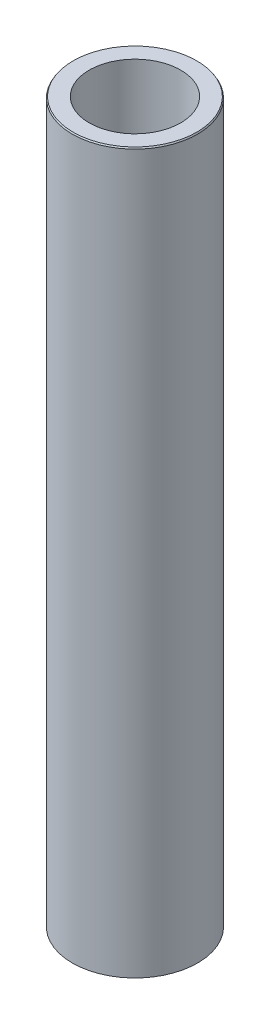
ISO-10303-21;
HEADER;
FILE_DESCRIPTION(('STEP AP214'),'2;1');
FILE_NAME('part.step','',(''),(''),'','','');
FILE_SCHEMA(('AUTOMOTIVE_DESIGN { 1 0 10303 214 1 1 1 1 }'));
ENDSEC;
DATA;
#1=APPLICATION_CONTEXT('core data for automotive mechanical design processes');
#2=APPLICATION_PROTOCOL_DEFINITION('international standard','automotive_design',2000,#1);
#3=PRODUCT_CONTEXT('',#1,'mechanical');
#4=PRODUCT('Part','Part','',(#3));
#5=PRODUCT_RELATED_PRODUCT_CATEGORY('part','',(#4));
#6=PRODUCT_DEFINITION_FORMATION('','',#4);
#7=PRODUCT_DEFINITION_CONTEXT('part definition',#1,'design');
#8=PRODUCT_DEFINITION('design','',#6,#7);
#9=PRODUCT_DEFINITION_SHAPE('','',#8);
#10=(LENGTH_UNIT() NAMED_UNIT(*) SI_UNIT(.MILLI.,.METRE.));
#11=(NAMED_UNIT(*) PLANE_ANGLE_UNIT() SI_UNIT($,.RADIAN.));
#12=(NAMED_UNIT(*) SI_UNIT($,.STERADIAN.) SOLID_ANGLE_UNIT());
#13=UNCERTAINTY_MEASURE_WITH_UNIT(LENGTH_MEASURE(1.E-05),#10,'distance_accuracy_value','');
#14=(GEOMETRIC_REPRESENTATION_CONTEXT(3) GLOBAL_UNCERTAINTY_ASSIGNED_CONTEXT((#13)) GLOBAL_UNIT_ASSIGNED_CONTEXT((#10,
#11,#12)) REPRESENTATION_CONTEXT('',''));
#15=CARTESIAN_POINT('',(0.,0.,0.));
#16=DIRECTION('',(0.,0.,1.));
#17=DIRECTION('',(1.,0.,0.));
#18=AXIS2_PLACEMENT_3D('',#15,#16,#17);
#19=CARTESIAN_POINT('',(0.,344.799066649294,0.));
#20=DIRECTION('',(0.,-1.,0.));
#21=DIRECTION('',(0.,0.,-1.));
#22=AXIS2_PLACEMENT_3D('',#19,#20,#21);
#23=CYLINDRICAL_SURFACE('',#22,30.);
#24=CARTESIAN_POINT('',(0.,344.162330356035,0.));
#25=DIRECTION('',(0.,1.,0.));
#26=DIRECTION('',(0.,0.,1.));
#27=AXIS2_PLACEMENT_3D('',#24,#25,#26);
#28=CIRCLE('',#27,30.);
#29=CARTESIAN_POINT('',(0.,344.162330356035,30.));
#30=VERTEX_POINT('',#29);
#31=EDGE_CURVE('E50',#30,#30,#28,.F.);
#32=ORIENTED_EDGE('',*,*,#31,.T.);
#33=EDGE_LOOP('',(#32));
#34=FACE_BOUND('',#33,.T.);
#35=CARTESIAN_POINT('',(0.,0.386848550844587,0.));
#36=DIRECTION('',(0.,1.,0.));
#37=DIRECTION('',(0.,0.,1.));
#38=AXIS2_PLACEMENT_3D('',#35,#36,#37);
#39=CIRCLE('',#38,30.);
#40=CARTESIAN_POINT('',(0.,0.386848550844587,30.));
#41=VERTEX_POINT('',#40);
#42=EDGE_CURVE('E51',#41,#41,#39,.T.);
#43=ORIENTED_EDGE('',*,*,#42,.T.);
#44=EDGE_LOOP('',(#43));
#45=FACE_BOUND('',#44,.T.);
#46=ADVANCED_FACE('F39',(#34,#45),#23,.T.);
#47=CARTESIAN_POINT('',(0.,344.799066649294,0.));
#48=DIRECTION('',(0.,1.,0.));
#49=DIRECTION('',(0.,0.,1.));
#50=AXIS2_PLACEMENT_3D('',#47,#48,#49);
#51=PLANE('',#50);
#52=CARTESIAN_POINT('',(0.,344.799066649294,0.));
#53=DIRECTION('',(0.,1.,0.));
#54=DIRECTION('',(0.,0.,1.));
#55=AXIS2_PLACEMENT_3D('',#52,#53,#54);
#56=CIRCLE('',#55,29.6131514491555);
#57=CARTESIAN_POINT('',(0.,344.799066649294,29.6131514491555));
#58=VERTEX_POINT('',#57);
#59=EDGE_CURVE('E54',#58,#58,#56,.T.);
#60=ORIENTED_EDGE('',*,*,#59,.T.);
#61=EDGE_LOOP('',(#60));
#62=FACE_BOUND('',#61,.T.);
#63=CARTESIAN_POINT('',(0.,344.799066649294,0.));
#64=DIRECTION('',(0.,1.,0.));
#65=DIRECTION('',(0.,0.,1.));
#66=AXIS2_PLACEMENT_3D('',#63,#64,#65);
#67=CIRCLE('',#66,21.9111066485558);
#68=CARTESIAN_POINT('',(0.,344.799066649294,21.9111066485558));
#69=VERTEX_POINT('',#68);
#70=EDGE_CURVE('E58',#69,#69,#67,.T.);
#71=ORIENTED_EDGE('',*,*,#70,.F.);
#72=EDGE_LOOP('',(#71));
#73=FACE_BOUND('',#72,.T.);
#74=ADVANCED_FACE('F69',(#62,#73),#51,.T.);
#75=CARTESIAN_POINT('',(0.,0.,0.));
#76=DIRECTION('',(0.,1.,0.));
#77=DIRECTION('',(0.,0.,1.));
#78=AXIS2_PLACEMENT_3D('',#75,#76,#77);
#79=PLANE('',#78);
#80=CARTESIAN_POINT('',(0.,0.,0.));
#81=DIRECTION('',(0.,1.,0.));
#82=DIRECTION('',(0.,0.,1.));
#83=AXIS2_PLACEMENT_3D('',#80,#81,#82);
#84=CIRCLE('',#83,29.3632637067408);
#85=CARTESIAN_POINT('',(0.,0.,29.3632637067408));
#86=VERTEX_POINT('',#85);
#87=EDGE_CURVE('E10',#86,#86,#84,.F.);
#88=ORIENTED_EDGE('',*,*,#87,.T.);
#89=EDGE_LOOP('',(#88));
#90=FACE_BOUND('',#89,.T.);
#91=CARTESIAN_POINT('',(0.,0.,0.));
#92=DIRECTION('',(0.,1.,0.));
#93=DIRECTION('',(0.,0.,1.));
#94=AXIS2_PLACEMENT_3D('',#91,#92,#93);
#95=CIRCLE('',#94,21.9111066485558);
#96=CARTESIAN_POINT('',(0.,0.,21.9111066485558));
#97=VERTEX_POINT('',#96);
#98=EDGE_CURVE('E63',#97,#97,#95,.T.);
#99=ORIENTED_EDGE('',*,*,#98,.T.);
#100=EDGE_LOOP('',(#99));
#101=FACE_BOUND('',#100,.T.);
#102=ADVANCED_FACE('F75',(#90,#101),#79,.F.);
#103=CARTESIAN_POINT('',(0.,344.799066649294,0.));
#104=DIRECTION('',(0.,-1.,0.));
#105=DIRECTION('',(0.,0.,-1.));
#106=AXIS2_PLACEMENT_3D('',#103,#104,#105);
#107=CYLINDRICAL_SURFACE('',#106,21.9111066485558);
#108=ORIENTED_EDGE('',*,*,#70,.T.);
#109=EDGE_LOOP('',(#108));
#110=FACE_BOUND('',#109,.T.);
#111=ORIENTED_EDGE('',*,*,#98,.F.);
#112=EDGE_LOOP('',(#111));
#113=FACE_BOUND('',#112,.T.);
#114=ADVANCED_FACE('F70',(#110,#113),#107,.F.);
#115=CARTESIAN_POINT('',(0.,344.799066649294,0.));
#116=DIRECTION('',(0.,-1.,0.));
#117=DIRECTION('',(0.,0.,-1.));
#118=AXIS2_PLACEMENT_3D('',#115,#116,#117);
#119=CONICAL_SURFACE('',#118,29.6131514491555,0.545951814440561);
#120=ORIENTED_EDGE('',*,*,#31,.F.);
#121=EDGE_LOOP('',(#120));
#122=FACE_BOUND('',#121,.T.);
#123=ORIENTED_EDGE('',*,*,#59,.F.);
#124=EDGE_LOOP('',(#123));
#125=FACE_BOUND('',#124,.T.);
#126=ADVANCED_FACE('F81',(#122,#125),#119,.T.);
#127=CARTESIAN_POINT('',(0.,0.386848550844587,0.));
#128=DIRECTION('',(0.,1.,0.));
#129=DIRECTION('',(0.,0.,1.));
#130=AXIS2_PLACEMENT_3D('',#127,#128,#129);
#131=CONICAL_SURFACE('',#130,30.,1.0248445123543);
#132=ORIENTED_EDGE('',*,*,#87,.F.);
#133=EDGE_LOOP('',(#132));
#134=FACE_BOUND('',#133,.T.);
#135=ORIENTED_EDGE('',*,*,#42,.F.);
#136=EDGE_LOOP('',(#135));
#137=FACE_BOUND('',#136,.T.);
#138=ADVANCED_FACE('F45',(#134,#137),#131,.T.);
#139=CLOSED_SHELL('',(#46,#74,#102,#114,#126,#138));
#140=MANIFOLD_SOLID_BREP('B2',#139);
#141=ADVANCED_BREP_SHAPE_REPRESENTATION('',(#18,#140),#14);
#142=SHAPE_DEFINITION_REPRESENTATION(#9,#141);
ENDSEC;
END-ISO-10303-21;
